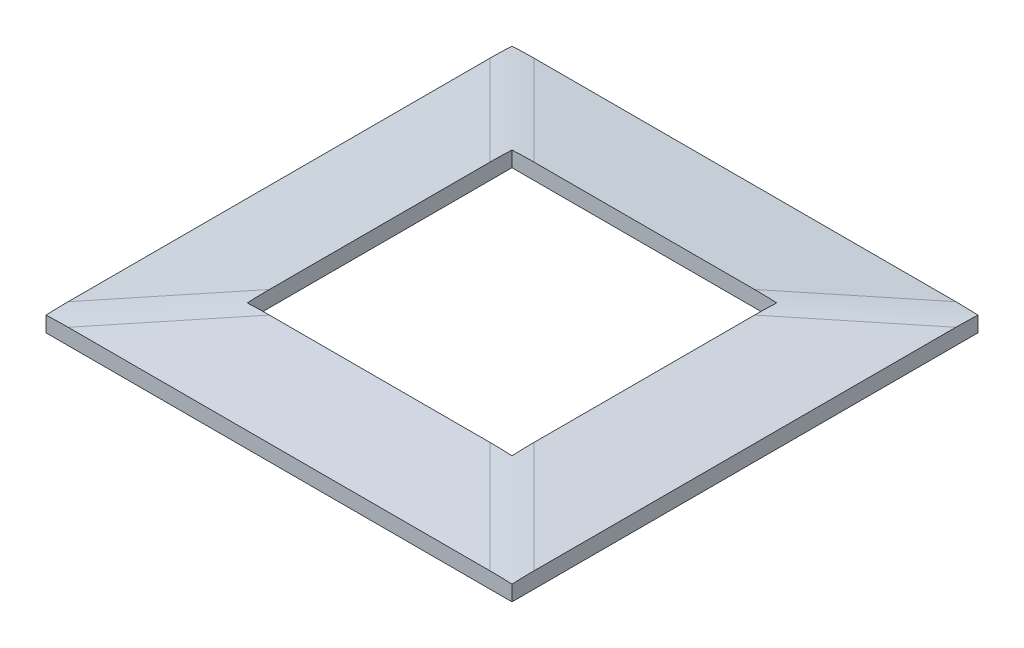
ISO-10303-21;
HEADER;
FILE_DESCRIPTION(('STEP AP214'),'2;1');
FILE_NAME('part.step','',(''),(''),'','','');
FILE_SCHEMA(('AUTOMOTIVE_DESIGN { 1 0 10303 214 1 1 1 1 }'));
ENDSEC;
DATA;
#1=APPLICATION_CONTEXT('core data for automotive mechanical design processes');
#2=APPLICATION_PROTOCOL_DEFINITION('international standard','automotive_design',2000,#1);
#3=PRODUCT_CONTEXT('',#1,'mechanical');
#4=PRODUCT('Part','Part','',(#3));
#5=PRODUCT_RELATED_PRODUCT_CATEGORY('part','',(#4));
#6=PRODUCT_DEFINITION_FORMATION('','',#4);
#7=PRODUCT_DEFINITION_CONTEXT('part definition',#1,'design');
#8=PRODUCT_DEFINITION('design','',#6,#7);
#9=PRODUCT_DEFINITION_SHAPE('','',#8);
#10=(LENGTH_UNIT() NAMED_UNIT(*) SI_UNIT(.MILLI.,.METRE.));
#11=(NAMED_UNIT(*) PLANE_ANGLE_UNIT() SI_UNIT($,.RADIAN.));
#12=(NAMED_UNIT(*) SI_UNIT($,.STERADIAN.) SOLID_ANGLE_UNIT());
#13=UNCERTAINTY_MEASURE_WITH_UNIT(LENGTH_MEASURE(1.E-05),#10,'distance_accuracy_value','');
#14=(GEOMETRIC_REPRESENTATION_CONTEXT(3) GLOBAL_UNCERTAINTY_ASSIGNED_CONTEXT((#13)) GLOBAL_UNIT_ASSIGNED_CONTEXT((#10,
#11,#12)) REPRESENTATION_CONTEXT('',''));
#15=CARTESIAN_POINT('',(0.,0.,0.));
#16=DIRECTION('',(0.,0.,1.));
#17=DIRECTION('',(1.,0.,0.));
#18=AXIS2_PLACEMENT_3D('',#15,#16,#17);
#19=CARTESIAN_POINT('',(44.,3.00000000000001,-44.));
#20=DIRECTION('',(0.,-0.994505452921406,0.104684784518043));
#21=DIRECTION('',(0.,-0.104684784518043,-0.994505452921406));
#22=AXIS2_PLACEMENT_3D('',#19,#20,#21);
#23=PLANE('',#22);
#24=DIRECTION('',(-1.,0.,0.));
#25=VECTOR('',#24,1.);
#26=CARTESIAN_POINT('',(44.,5.00000000000001,-25.));
#27=LINE('',#26,#25);
#28=CARTESIAN_POINT('',(20.8126086192783,5.00000000000001,-25.));
#29=VERTEX_POINT('',#28);
#30=CARTESIAN_POINT('',(-20.8126086192782,5.00000000000001,-25.));
#31=VERTEX_POINT('',#30);
#32=EDGE_CURVE('E260',#29,#31,#27,.T.);
#33=ORIENTED_EDGE('',*,*,#32,.F.);
#34=DIRECTION('',(-0.705156138073945,0.0742269619025208,0.705156138073945));
#35=VECTOR('',#34,1.);
#36=CARTESIAN_POINT('',(41.8947687961936,2.78082524453524,-46.0821601769153));
#37=LINE('',#36,#35);
#38=CARTESIAN_POINT('',(39.8126086192783,3.00000000000001,-44.));
#39=VERTEX_POINT('',#38);
#40=EDGE_CURVE('E224',#29,#39,#37,.F.);
#41=ORIENTED_EDGE('',*,*,#40,.T.);
#42=DIRECTION('',(-1.,0.,0.));
#43=VECTOR('',#42,1.);
#44=CARTESIAN_POINT('',(44.,3.00000000000001,-44.));
#45=LINE('',#44,#43);
#46=CARTESIAN_POINT('',(-39.8126086192781,3.00000000000001,-44.));
#47=VERTEX_POINT('',#46);
#48=EDGE_CURVE('E300',#39,#47,#45,.T.);
#49=ORIENTED_EDGE('',*,*,#48,.T.);
#50=DIRECTION('',(-0.705156138073945,-0.0742269619025208,-0.705156138073945));
#51=VECTOR('',#50,1.);
#52=CARTESIAN_POINT('',(-22.8947687961936,4.78082524453524,-27.0821601769154));
#53=LINE('',#52,#51);
#54=EDGE_CURVE('E222',#47,#31,#53,.F.);
#55=ORIENTED_EDGE('',*,*,#54,.T.);
#56=EDGE_LOOP('',(#33,#41,#49,#55));
#57=FACE_BOUND('',#56,.T.);
#58=ADVANCED_FACE('F38',(#57),#23,.F.);
#59=CARTESIAN_POINT('',(44.,2.99999999999999,44.));
#60=DIRECTION('',(0.,-0.994505452921406,-0.104684784518043));
#61=DIRECTION('',(0.,0.104684784518043,-0.994505452921406));
#62=AXIS2_PLACEMENT_3D('',#59,#60,#61);
#63=PLANE('',#62);
#64=DIRECTION('',(-1.,0.,0.));
#65=VECTOR('',#64,1.);
#66=CARTESIAN_POINT('',(44.,5.,25.));
#67=LINE('',#66,#65);
#68=CARTESIAN_POINT('',(20.8126086192784,5.,25.));
#69=VERTEX_POINT('',#68);
#70=CARTESIAN_POINT('',(-20.8126086192783,5.,25.));
#71=VERTEX_POINT('',#70);
#72=EDGE_CURVE('E256',#69,#71,#67,.T.);
#73=ORIENTED_EDGE('',*,*,#72,.T.);
#74=DIRECTION('',(0.705156138073945,0.0742269619025208,-0.705156138073945));
#75=VECTOR('',#74,1.);
#76=CARTESIAN_POINT('',(-41.8947687961936,2.78082524453523,46.0821601769153));
#77=LINE('',#76,#75);
#78=CARTESIAN_POINT('',(-39.8126086192783,2.99999999999999,44.));
#79=VERTEX_POINT('',#78);
#80=EDGE_CURVE('E53',#71,#79,#77,.F.);
#81=ORIENTED_EDGE('',*,*,#80,.T.);
#82=DIRECTION('',(-1.,0.,0.));
#83=VECTOR('',#82,1.);
#84=CARTESIAN_POINT('',(44.,2.99999999999999,44.));
#85=LINE('',#84,#83);
#86=CARTESIAN_POINT('',(39.8126086192784,2.99999999999999,44.));
#87=VERTEX_POINT('',#86);
#88=EDGE_CURVE('E257',#87,#79,#85,.T.);
#89=ORIENTED_EDGE('',*,*,#88,.F.);
#90=DIRECTION('',(0.705156138073945,-0.0742269619025208,0.705156138073945));
#91=VECTOR('',#90,1.);
#92=CARTESIAN_POINT('',(22.8947687961937,4.78082524453525,27.0821601769153));
#93=LINE('',#92,#91);
#94=EDGE_CURVE('E251',#87,#69,#93,.F.);
#95=ORIENTED_EDGE('',*,*,#94,.T.);
#96=EDGE_LOOP('',(#73,#81,#89,#95));
#97=FACE_BOUND('',#96,.T.);
#98=ADVANCED_FACE('F255',(#97),#63,.F.);
#99=CARTESIAN_POINT('',(44.,0.,0.));
#100=DIRECTION('',(-1.,0.,0.));
#101=DIRECTION('',(0.,0.,1.));
#102=AXIS2_PLACEMENT_3D('',#99,#100,#101);
#103=PLANE('',#102);
#104=DIRECTION('',(0.,1.,0.));
#105=VECTOR('',#104,1.);
#106=CARTESIAN_POINT('',(44.,0.,-44.));
#107=LINE('',#106,#105);
#108=CARTESIAN_POINT('',(44.,0.,-44.));
#109=VERTEX_POINT('',#108);
#110=CARTESIAN_POINT('',(44.,2.88965412361021,-44.));
#111=VERTEX_POINT('',#110);
#112=EDGE_CURVE('E288',#109,#111,#107,.T.);
#113=ORIENTED_EDGE('',*,*,#112,.T.);
#114=CARTESIAN_POINT('',(44.,-37.2209961569322,-44.));
#115=DIRECTION('',(-1.,0.,0.));
#116=DIRECTION('',(0.,-0.104684784518043,-0.994505452921406));
#117=AXIS2_PLACEMENT_3D('',#114,#115,#116);
#118=ELLIPSE('',#117,56.7250256223473,40.);
#119=CARTESIAN_POINT('',(44.,3.00000000000001,-39.8126086192783));
#120=VERTEX_POINT('',#119);
#121=EDGE_CURVE('E232',#111,#120,#118,.F.);
#122=ORIENTED_EDGE('',*,*,#121,.T.);
#123=DIRECTION('',(0.,0.,1.));
#124=VECTOR('',#123,1.);
#125=CARTESIAN_POINT('',(44.,3.00000000000001,-44.));
#126=LINE('',#125,#124);
#127=CARTESIAN_POINT('',(44.,3.00000000000001,39.8126086192781));
#128=VERTEX_POINT('',#127);
#129=EDGE_CURVE('E275',#120,#128,#126,.T.);
#130=ORIENTED_EDGE('',*,*,#129,.T.);
#131=CARTESIAN_POINT('',(44.,-37.2209961569322,43.9999999999999));
#132=DIRECTION('',(-1.,0.,0.));
#133=DIRECTION('',(0.,0.104684784518043,-0.994505452921406));
#134=AXIS2_PLACEMENT_3D('',#131,#132,#133);
#135=ELLIPSE('',#134,56.7250256223473,40.);
#136=CARTESIAN_POINT('',(44.,2.88965412361021,44.));
#137=VERTEX_POINT('',#136);
#138=EDGE_CURVE('E230',#128,#137,#135,.F.);
#139=ORIENTED_EDGE('',*,*,#138,.T.);
#140=DIRECTION('',(0.,-1.,0.));
#141=VECTOR('',#140,1.);
#142=CARTESIAN_POINT('',(44.,0.,44.));
#143=LINE('',#142,#141);
#144=CARTESIAN_POINT('',(44.,0.,44.));
#145=VERTEX_POINT('',#144);
#146=EDGE_CURVE('E283',#137,#145,#143,.T.);
#147=ORIENTED_EDGE('',*,*,#146,.T.);
#148=DIRECTION('',(0.,0.,-1.));
#149=VECTOR('',#148,1.);
#150=CARTESIAN_POINT('',(44.,0.,-44.));
#151=LINE('',#150,#149);
#152=EDGE_CURVE('E285',#145,#109,#151,.T.);
#153=ORIENTED_EDGE('',*,*,#152,.T.);
#154=EDGE_LOOP('',(#113,#122,#130,#139,#147,#153));
#155=FACE_BOUND('',#154,.T.);
#156=ADVANCED_FACE('F344',(#155),#103,.F.);
#157=CARTESIAN_POINT('',(-44.,0.,0.));
#158=DIRECTION('',(-1.,0.,0.));
#159=DIRECTION('',(0.,0.,1.));
#160=AXIS2_PLACEMENT_3D('',#157,#158,#159);
#161=PLANE('',#160);
#162=DIRECTION('',(0.,0.,1.));
#163=VECTOR('',#162,1.);
#164=CARTESIAN_POINT('',(-44.,2.99999999999999,-44.));
#165=LINE('',#164,#163);
#166=CARTESIAN_POINT('',(-44.,2.99999999999999,-39.8126086192784));
#167=VERTEX_POINT('',#166);
#168=CARTESIAN_POINT('',(-44.,2.99999999999999,39.8126086192783));
#169=VERTEX_POINT('',#168);
#170=EDGE_CURVE('E277',#167,#169,#165,.T.);
#171=ORIENTED_EDGE('',*,*,#170,.F.);
#172=CARTESIAN_POINT('',(-44.,-37.2209961569322,-44.0000000000001));
#173=DIRECTION('',(-1.,0.,0.));
#174=DIRECTION('',(0.,0.104684784518043,0.994505452921406));
#175=AXIS2_PLACEMENT_3D('',#172,#173,#174);
#176=ELLIPSE('',#175,56.7250256223473,40.);
#177=CARTESIAN_POINT('',(-44.,2.8896541236102,-44.));
#178=VERTEX_POINT('',#177);
#179=EDGE_CURVE('E242',#167,#178,#176,.T.);
#180=ORIENTED_EDGE('',*,*,#179,.T.);
#181=DIRECTION('',(0.,1.,0.));
#182=VECTOR('',#181,1.);
#183=CARTESIAN_POINT('',(-44.,0.,-44.));
#184=LINE('',#183,#182);
#185=CARTESIAN_POINT('',(-44.,0.,-44.));
#186=VERTEX_POINT('',#185);
#187=EDGE_CURVE('E286',#186,#178,#184,.T.);
#188=ORIENTED_EDGE('',*,*,#187,.F.);
#189=DIRECTION('',(0.,0.,-1.));
#190=VECTOR('',#189,1.);
#191=CARTESIAN_POINT('',(-44.,0.,-44.));
#192=LINE('',#191,#190);
#193=CARTESIAN_POINT('',(-44.,0.,44.));
#194=VERTEX_POINT('',#193);
#195=EDGE_CURVE('E293',#194,#186,#192,.T.);
#196=ORIENTED_EDGE('',*,*,#195,.F.);
#197=DIRECTION('',(0.,-1.,0.));
#198=VECTOR('',#197,1.);
#199=CARTESIAN_POINT('',(-44.,0.,44.));
#200=LINE('',#199,#198);
#201=CARTESIAN_POINT('',(-44.,2.88965412361021,44.));
#202=VERTEX_POINT('',#201);
#203=EDGE_CURVE('E291',#202,#194,#200,.T.);
#204=ORIENTED_EDGE('',*,*,#203,.F.);
#205=CARTESIAN_POINT('',(-44.,-37.2209961569322,44.));
#206=DIRECTION('',(-1.,0.,0.));
#207=DIRECTION('',(0.,-0.104684784518043,0.994505452921406));
#208=AXIS2_PLACEMENT_3D('',#205,#206,#207);
#209=ELLIPSE('',#208,56.7250256223473,40.);
#210=EDGE_CURVE('E240',#202,#169,#209,.T.);
#211=ORIENTED_EDGE('',*,*,#210,.T.);
#212=EDGE_LOOP('',(#171,#180,#188,#196,#204,#211));
#213=FACE_BOUND('',#212,.T.);
#214=ADVANCED_FACE('F319',(#213),#161,.T.);
#215=CARTESIAN_POINT('',(44.,0.,44.));
#216=DIRECTION('',(0.,0.,-1.));
#217=DIRECTION('',(-1.,0.,0.));
#218=AXIS2_PLACEMENT_3D('',#215,#216,#217);
#219=PLANE('',#218);
#220=ORIENTED_EDGE('',*,*,#88,.T.);
#221=CARTESIAN_POINT('',(-44.,-37.2209961569322,44.));
#222=DIRECTION('',(0.,0.,-1.));
#223=DIRECTION('',(-0.994505452921406,-0.104684784518043,0.));
#224=AXIS2_PLACEMENT_3D('',#221,#222,#223);
#225=ELLIPSE('',#224,56.7250256223473,40.);
#226=EDGE_CURVE('E12',#79,#202,#225,.F.);
#227=ORIENTED_EDGE('',*,*,#226,.T.);
#228=ORIENTED_EDGE('',*,*,#203,.T.);
#229=DIRECTION('',(-1.,0.,0.));
#230=VECTOR('',#229,1.);
#231=CARTESIAN_POINT('',(44.,0.,44.));
#232=LINE('',#231,#230);
#233=EDGE_CURVE('E196',#145,#194,#232,.T.);
#234=ORIENTED_EDGE('',*,*,#233,.F.);
#235=ORIENTED_EDGE('',*,*,#146,.F.);
#236=CARTESIAN_POINT('',(44.0000000000001,-37.2209961569322,44.));
#237=DIRECTION('',(0.,0.,-1.));
#238=DIRECTION('',(-0.994505452921406,0.104684784518043,0.));
#239=AXIS2_PLACEMENT_3D('',#236,#237,#238);
#240=ELLIPSE('',#239,56.7250256223473,40.);
#241=EDGE_CURVE('E46',#137,#87,#240,.F.);
#242=ORIENTED_EDGE('',*,*,#241,.T.);
#243=EDGE_LOOP('',(#220,#227,#228,#234,#235,#242));
#244=FACE_BOUND('',#243,.T.);
#245=ADVANCED_FACE('F312',(#244),#219,.F.);
#246=CARTESIAN_POINT('',(44.,0.,-44.));
#247=DIRECTION('',(0.,1.,0.));
#248=DIRECTION('',(0.,0.,1.));
#249=AXIS2_PLACEMENT_3D('',#246,#247,#248);
#250=PLANE('',#249);
#251=DIRECTION('',(-1.,0.,0.));
#252=VECTOR('',#251,1.);
#253=CARTESIAN_POINT('',(-41.5,0.,42.0556324276603));
#254=LINE('',#253,#252);
#255=CARTESIAN_POINT('',(41.5,0.,42.0556324276603));
#256=VERTEX_POINT('',#255);
#257=CARTESIAN_POINT('',(-41.5,0.,42.0556324276603));
#258=VERTEX_POINT('',#257);
#259=EDGE_CURVE('E398',#256,#258,#254,.T.);
#260=ORIENTED_EDGE('',*,*,#259,.F.);
#261=DIRECTION('',(0.,0.,1.));
#262=VECTOR('',#261,1.);
#263=CARTESIAN_POINT('',(41.5,0.,42.0556324276603));
#264=LINE('',#263,#262);
#265=CARTESIAN_POINT('',(41.5,0.,-42.0556324276603));
#266=VERTEX_POINT('',#265);
#267=EDGE_CURVE('E401',#266,#256,#264,.T.);
#268=ORIENTED_EDGE('',*,*,#267,.F.);
#269=DIRECTION('',(1.,0.,0.));
#270=VECTOR('',#269,1.);
#271=CARTESIAN_POINT('',(-41.5,0.,-42.0556324276603));
#272=LINE('',#271,#270);
#273=CARTESIAN_POINT('',(-41.5,0.,-42.0556324276603));
#274=VERTEX_POINT('',#273);
#275=EDGE_CURVE('E391',#274,#266,#272,.T.);
#276=ORIENTED_EDGE('',*,*,#275,.F.);
#277=DIRECTION('',(0.,0.,-1.));
#278=VECTOR('',#277,1.);
#279=CARTESIAN_POINT('',(-41.5,0.,42.0556324276603));
#280=LINE('',#279,#278);
#281=EDGE_CURVE('E395',#258,#274,#280,.T.);
#282=ORIENTED_EDGE('',*,*,#281,.F.);
#283=EDGE_LOOP('',(#260,#268,#276,#282));
#284=FACE_BOUND('',#283,.T.);
#285=ORIENTED_EDGE('',*,*,#195,.T.);
#286=DIRECTION('',(-1.,0.,0.));
#287=VECTOR('',#286,1.);
#288=CARTESIAN_POINT('',(44.,0.,-44.));
#289=LINE('',#288,#287);
#290=EDGE_CURVE('E303',#109,#186,#289,.T.);
#291=ORIENTED_EDGE('',*,*,#290,.F.);
#292=ORIENTED_EDGE('',*,*,#152,.F.);
#293=ORIENTED_EDGE('',*,*,#233,.T.);
#294=EDGE_LOOP('',(#285,#291,#292,#293));
#295=FACE_BOUND('',#294,.T.);
#296=ADVANCED_FACE('F309',(#284,#295),#250,.F.);
#297=CARTESIAN_POINT('',(44.,0.,-44.));
#298=DIRECTION('',(0.,0.,1.));
#299=DIRECTION('',(1.,0.,0.));
#300=AXIS2_PLACEMENT_3D('',#297,#298,#299);
#301=PLANE('',#300);
#302=ORIENTED_EDGE('',*,*,#48,.F.);
#303=CARTESIAN_POINT('',(44.,-37.2209961569322,-44.));
#304=DIRECTION('',(0.,0.,1.));
#305=DIRECTION('',(0.994505452921406,-0.104684784518043,0.));
#306=AXIS2_PLACEMENT_3D('',#303,#304,#305);
#307=ELLIPSE('',#306,56.7250256223473,40.);
#308=EDGE_CURVE('E228',#39,#111,#307,.F.);
#309=ORIENTED_EDGE('',*,*,#308,.T.);
#310=ORIENTED_EDGE('',*,*,#112,.F.);
#311=ORIENTED_EDGE('',*,*,#290,.T.);
#312=ORIENTED_EDGE('',*,*,#187,.T.);
#313=CARTESIAN_POINT('',(-43.9999999999999,-37.2209961569322,-44.));
#314=DIRECTION('',(0.,0.,1.));
#315=DIRECTION('',(0.994505452921406,0.104684784518043,0.));
#316=AXIS2_PLACEMENT_3D('',#313,#314,#315);
#317=ELLIPSE('',#316,56.7250256223473,40.);
#318=EDGE_CURVE('E226',#178,#47,#317,.F.);
#319=ORIENTED_EDGE('',*,*,#318,.T.);
#320=EDGE_LOOP('',(#302,#309,#310,#311,#312,#319));
#321=FACE_BOUND('',#320,.T.);
#322=ADVANCED_FACE('F323',(#321),#301,.F.);
#323=CARTESIAN_POINT('',(-44.,2.99999999999999,-44.));
#324=DIRECTION('',(-0.104684784518043,0.994505452921406,0.));
#325=DIRECTION('',(-0.994505452921406,-0.104684784518043,0.));
#326=AXIS2_PLACEMENT_3D('',#323,#324,#325);
#327=PLANE('',#326);
#328=DIRECTION('',(0.,0.,1.));
#329=VECTOR('',#328,1.);
#330=CARTESIAN_POINT('',(-25.,5.,-44.));
#331=LINE('',#330,#329);
#332=CARTESIAN_POINT('',(-25.,5.,-20.8126086192784));
#333=VERTEX_POINT('',#332);
#334=CARTESIAN_POINT('',(-25.,5.,20.8126086192783));
#335=VERTEX_POINT('',#334);
#336=EDGE_CURVE('E274',#333,#335,#331,.T.);
#337=ORIENTED_EDGE('',*,*,#336,.F.);
#338=DIRECTION('',(-0.705156138073945,-0.0742269619025208,-0.705156138073945));
#339=VECTOR('',#338,1.);
#340=CARTESIAN_POINT('',(-46.0821601769153,2.78082524453523,-41.8947687961937));
#341=LINE('',#340,#339);
#342=EDGE_CURVE('E237',#333,#167,#341,.T.);
#343=ORIENTED_EDGE('',*,*,#342,.T.);
#344=ORIENTED_EDGE('',*,*,#170,.T.);
#345=DIRECTION('',(0.705156138073945,0.0742269619025208,-0.705156138073945));
#346=VECTOR('',#345,1.);
#347=CARTESIAN_POINT('',(-27.0821601769154,4.78082524453524,22.8947687961936));
#348=LINE('',#347,#346);
#349=EDGE_CURVE('E234',#169,#335,#348,.T.);
#350=ORIENTED_EDGE('',*,*,#349,.T.);
#351=EDGE_LOOP('',(#337,#343,#344,#350));
#352=FACE_BOUND('',#351,.T.);
#353=ADVANCED_FACE('F362',(#352),#327,.T.);
#354=CARTESIAN_POINT('',(44.,3.00000000000001,-44.));
#355=DIRECTION('',(0.104684784518043,0.994505452921406,0.));
#356=DIRECTION('',(-0.994505452921406,0.104684784518043,0.));
#357=AXIS2_PLACEMENT_3D('',#354,#355,#356);
#358=PLANE('',#357);
#359=ORIENTED_EDGE('',*,*,#129,.F.);
#360=DIRECTION('',(-0.705156138073945,0.0742269619025208,0.705156138073945));
#361=VECTOR('',#360,1.);
#362=CARTESIAN_POINT('',(27.0821601769154,4.78082524453525,-22.8947687961936));
#363=LINE('',#362,#361);
#364=CARTESIAN_POINT('',(25.,5.00000000000001,-20.8126086192783));
#365=VERTEX_POINT('',#364);
#366=EDGE_CURVE('E211',#120,#365,#363,.T.);
#367=ORIENTED_EDGE('',*,*,#366,.T.);
#368=DIRECTION('',(0.,0.,1.));
#369=VECTOR('',#368,1.);
#370=CARTESIAN_POINT('',(25.,5.00000000000001,-44.));
#371=LINE('',#370,#369);
#372=CARTESIAN_POINT('',(25.,5.00000000000001,20.8126086192782));
#373=VERTEX_POINT('',#372);
#374=EDGE_CURVE('E268',#365,#373,#371,.T.);
#375=ORIENTED_EDGE('',*,*,#374,.T.);
#376=DIRECTION('',(0.705156138073945,-0.0742269619025208,0.705156138073945));
#377=VECTOR('',#376,1.);
#378=CARTESIAN_POINT('',(46.0821601769154,2.78082524453523,41.8947687961936));
#379=LINE('',#378,#377);
#380=EDGE_CURVE('E208',#373,#128,#379,.T.);
#381=ORIENTED_EDGE('',*,*,#380,.T.);
#382=EDGE_LOOP('',(#359,#367,#375,#381));
#383=FACE_BOUND('',#382,.T.);
#384=ADVANCED_FACE('F271',(#383),#358,.T.);
#385=CARTESIAN_POINT('',(41.5,1.99999999999999,42.0556324276603));
#386=DIRECTION('',(1.,0.,0.));
#387=DIRECTION('',(0.,0.,-1.));
#388=AXIS2_PLACEMENT_3D('',#385,#386,#387);
#389=PLANE('',#388);
#390=ORIENTED_EDGE('',*,*,#267,.T.);
#391=DIRECTION('',(0.,-1.,0.));
#392=VECTOR('',#391,1.);
#393=CARTESIAN_POINT('',(41.5,1.99999999999999,42.0556324276603));
#394=LINE('',#393,#392);
#395=CARTESIAN_POINT('',(41.5,1.99999999999999,42.0556324276603));
#396=VERTEX_POINT('',#395);
#397=EDGE_CURVE('E382',#396,#256,#394,.T.);
#398=ORIENTED_EDGE('',*,*,#397,.F.);
#399=DIRECTION('',(0.,0.,1.));
#400=VECTOR('',#399,1.);
#401=CARTESIAN_POINT('',(41.5,1.99999999999999,42.0556324276603));
#402=LINE('',#401,#400);
#403=CARTESIAN_POINT('',(41.5,2.00000000000001,-42.0556324276603));
#404=VERTEX_POINT('',#403);
#405=EDGE_CURVE('E394',#404,#396,#402,.T.);
#406=ORIENTED_EDGE('',*,*,#405,.F.);
#407=DIRECTION('',(0.,-1.,0.));
#408=VECTOR('',#407,1.);
#409=CARTESIAN_POINT('',(41.5,2.00000000000001,-42.0556324276603));
#410=LINE('',#409,#408);
#411=EDGE_CURVE('E279',#404,#266,#410,.T.);
#412=ORIENTED_EDGE('',*,*,#411,.T.);
#413=EDGE_LOOP('',(#390,#398,#406,#412));
#414=FACE_BOUND('',#413,.T.);
#415=ADVANCED_FACE('F419',(#414),#389,.F.);
#416=CARTESIAN_POINT('',(-41.5,2.00000000000001,-42.0556324276603));
#417=DIRECTION('',(0.,0.,-1.));
#418=DIRECTION('',(0.,1.,0.));
#419=AXIS2_PLACEMENT_3D('',#416,#417,#418);
#420=PLANE('',#419);
#421=ORIENTED_EDGE('',*,*,#275,.T.);
#422=ORIENTED_EDGE('',*,*,#411,.F.);
#423=DIRECTION('',(1.,0.,0.));
#424=VECTOR('',#423,1.);
#425=CARTESIAN_POINT('',(-41.5,2.00000000000001,-42.0556324276603));
#426=LINE('',#425,#424);
#427=CARTESIAN_POINT('',(-41.5,2.00000000000001,-42.0556324276603));
#428=VERTEX_POINT('',#427);
#429=EDGE_CURVE('E386',#428,#404,#426,.T.);
#430=ORIENTED_EDGE('',*,*,#429,.F.);
#431=DIRECTION('',(0.,-1.,0.));
#432=VECTOR('',#431,1.);
#433=CARTESIAN_POINT('',(-41.5,2.00000000000001,-42.0556324276603));
#434=LINE('',#433,#432);
#435=EDGE_CURVE('E388',#428,#274,#434,.T.);
#436=ORIENTED_EDGE('',*,*,#435,.T.);
#437=EDGE_LOOP('',(#421,#422,#430,#436));
#438=FACE_BOUND('',#437,.T.);
#439=ADVANCED_FACE('F429',(#438),#420,.F.);
#440=CARTESIAN_POINT('',(-41.5,1.99999999999999,42.0556324276603));
#441=DIRECTION('',(-1.,0.,0.));
#442=DIRECTION('',(0.,0.,1.));
#443=AXIS2_PLACEMENT_3D('',#440,#441,#442);
#444=PLANE('',#443);
#445=ORIENTED_EDGE('',*,*,#281,.T.);
#446=ORIENTED_EDGE('',*,*,#435,.F.);
#447=DIRECTION('',(0.,0.,-1.));
#448=VECTOR('',#447,1.);
#449=CARTESIAN_POINT('',(-41.5,1.99999999999999,42.0556324276603));
#450=LINE('',#449,#448);
#451=CARTESIAN_POINT('',(-41.5,1.99999999999999,42.0556324276603));
#452=VERTEX_POINT('',#451);
#453=EDGE_CURVE('E405',#452,#428,#450,.T.);
#454=ORIENTED_EDGE('',*,*,#453,.F.);
#455=DIRECTION('',(0.,-1.,0.));
#456=VECTOR('',#455,1.);
#457=CARTESIAN_POINT('',(-41.5,1.99999999999999,42.0556324276603));
#458=LINE('',#457,#456);
#459=EDGE_CURVE('E385',#452,#258,#458,.T.);
#460=ORIENTED_EDGE('',*,*,#459,.T.);
#461=EDGE_LOOP('',(#445,#446,#454,#460));
#462=FACE_BOUND('',#461,.T.);
#463=ADVANCED_FACE('F427',(#462),#444,.F.);
#464=CARTESIAN_POINT('',(-41.5,1.99999999999999,42.0556324276603));
#465=DIRECTION('',(0.,0.,1.));
#466=DIRECTION('',(0.,-1.,0.));
#467=AXIS2_PLACEMENT_3D('',#464,#465,#466);
#468=PLANE('',#467);
#469=ORIENTED_EDGE('',*,*,#259,.T.);
#470=ORIENTED_EDGE('',*,*,#459,.F.);
#471=DIRECTION('',(-1.,0.,0.));
#472=VECTOR('',#471,1.);
#473=CARTESIAN_POINT('',(-41.5,1.99999999999999,42.0556324276603));
#474=LINE('',#473,#472);
#475=EDGE_CURVE('E408',#396,#452,#474,.T.);
#476=ORIENTED_EDGE('',*,*,#475,.F.);
#477=ORIENTED_EDGE('',*,*,#397,.T.);
#478=EDGE_LOOP('',(#469,#470,#476,#477));
#479=FACE_BOUND('',#478,.T.);
#480=ADVANCED_FACE('F423',(#479),#468,.F.);
#481=CARTESIAN_POINT('',(0.,2.,0.));
#482=DIRECTION('',(0.,-1.,0.));
#483=DIRECTION('',(0.,0.,-1.));
#484=AXIS2_PLACEMENT_3D('',#481,#482,#483);
#485=PLANE('',#484);
#486=DIRECTION('',(0.,0.,1.));
#487=VECTOR('',#486,1.);
#488=CARTESIAN_POINT('',(25.,2.,0.));
#489=LINE('',#488,#487);
#490=CARTESIAN_POINT('',(25.,2.00000000000001,-25.));
#491=VERTEX_POINT('',#490);
#492=CARTESIAN_POINT('',(25.,1.99999999999999,25.));
#493=VERTEX_POINT('',#492);
#494=EDGE_CURVE('E203',#491,#493,#489,.T.);
#495=ORIENTED_EDGE('',*,*,#494,.F.);
#496=DIRECTION('',(1.,0.,0.));
#497=VECTOR('',#496,1.);
#498=CARTESIAN_POINT('',(0.,2.00000000000001,-25.));
#499=LINE('',#498,#497);
#500=CARTESIAN_POINT('',(-25.,2.,-25.));
#501=VERTEX_POINT('',#500);
#502=EDGE_CURVE('E201',#501,#491,#499,.T.);
#503=ORIENTED_EDGE('',*,*,#502,.F.);
#504=DIRECTION('',(0.,0.,-1.));
#505=VECTOR('',#504,1.);
#506=CARTESIAN_POINT('',(-25.,2.,0.));
#507=LINE('',#506,#505);
#508=CARTESIAN_POINT('',(-25.,1.99999999999999,25.));
#509=VERTEX_POINT('',#508);
#510=EDGE_CURVE('E180',#509,#501,#507,.T.);
#511=ORIENTED_EDGE('',*,*,#510,.F.);
#512=DIRECTION('',(-1.,0.,0.));
#513=VECTOR('',#512,1.);
#514=CARTESIAN_POINT('',(0.,1.99999999999999,25.));
#515=LINE('',#514,#513);
#516=EDGE_CURVE('E190',#493,#509,#515,.T.);
#517=ORIENTED_EDGE('',*,*,#516,.F.);
#518=EDGE_LOOP('',(#495,#503,#511,#517));
#519=FACE_BOUND('',#518,.T.);
#520=ORIENTED_EDGE('',*,*,#405,.T.);
#521=ORIENTED_EDGE('',*,*,#475,.T.);
#522=ORIENTED_EDGE('',*,*,#453,.T.);
#523=ORIENTED_EDGE('',*,*,#429,.T.);
#524=EDGE_LOOP('',(#520,#521,#522,#523));
#525=FACE_BOUND('',#524,.T.);
#526=ADVANCED_FACE('F198',(#519,#525),#485,.T.);
#527=CARTESIAN_POINT('',(25.,5.00000000000002,25.));
#528=DIRECTION('',(1.,0.,0.));
#529=DIRECTION('',(0.,0.,-1.));
#530=AXIS2_PLACEMENT_3D('',#527,#528,#529);
#531=PLANE('',#530);
#532=ORIENTED_EDGE('',*,*,#374,.F.);
#533=CARTESIAN_POINT('',(25.,-35.2209961569322,-25.));
#534=DIRECTION('',(1.,0.,0.));
#535=DIRECTION('',(0.,-0.104684784518043,-0.994505452921406));
#536=AXIS2_PLACEMENT_3D('',#533,#534,#535);
#537=ELLIPSE('',#536,56.7250256223473,40.);
#538=CARTESIAN_POINT('',(25.,4.88965412361022,-25.));
#539=VERTEX_POINT('',#538);
#540=EDGE_CURVE('E216',#365,#539,#537,.F.);
#541=ORIENTED_EDGE('',*,*,#540,.T.);
#542=DIRECTION('',(0.,-1.,0.));
#543=VECTOR('',#542,1.);
#544=CARTESIAN_POINT('',(25.,5.00000000000004,-25.));
#545=LINE('',#544,#543);
#546=EDGE_CURVE('E338',#539,#491,#545,.T.);
#547=ORIENTED_EDGE('',*,*,#546,.T.);
#548=ORIENTED_EDGE('',*,*,#494,.T.);
#549=DIRECTION('',(0.,-1.,0.));
#550=VECTOR('',#549,1.);
#551=CARTESIAN_POINT('',(25.,5.00000000000002,25.));
#552=LINE('',#551,#550);
#553=CARTESIAN_POINT('',(25.,4.88965412361022,25.));
#554=VERTEX_POINT('',#553);
#555=EDGE_CURVE('E187',#554,#493,#552,.T.);
#556=ORIENTED_EDGE('',*,*,#555,.F.);
#557=CARTESIAN_POINT('',(25.,-35.2209961569322,24.9999999999999));
#558=DIRECTION('',(1.,0.,0.));
#559=DIRECTION('',(0.,0.104684784518043,-0.994505452921406));
#560=AXIS2_PLACEMENT_3D('',#557,#558,#559);
#561=ELLIPSE('',#560,56.7250256223473,40.);
#562=EDGE_CURVE('E214',#554,#373,#561,.F.);
#563=ORIENTED_EDGE('',*,*,#562,.T.);
#564=EDGE_LOOP('',(#532,#541,#547,#548,#556,#563));
#565=FACE_BOUND('',#564,.T.);
#566=ADVANCED_FACE('F267',(#565),#531,.F.);
#567=CARTESIAN_POINT('',(-25.,5.00000000000004,-25.));
#568=DIRECTION('',(0.,0.,-1.));
#569=DIRECTION('',(0.,1.,0.));
#570=AXIS2_PLACEMENT_3D('',#567,#568,#569);
#571=PLANE('',#570);
#572=ORIENTED_EDGE('',*,*,#546,.F.);
#573=CARTESIAN_POINT('',(25.,-35.2209961569322,-25.));
#574=DIRECTION('',(0.,0.,-1.));
#575=DIRECTION('',(0.994505452921406,-0.104684784518043,0.));
#576=AXIS2_PLACEMENT_3D('',#573,#574,#575);
#577=ELLIPSE('',#576,56.7250256223473,40.);
#578=EDGE_CURVE('E220',#539,#29,#577,.F.);
#579=ORIENTED_EDGE('',*,*,#578,.T.);
#580=ORIENTED_EDGE('',*,*,#32,.T.);
#581=CARTESIAN_POINT('',(-24.9999999999999,-35.2209961569322,-25.));
#582=DIRECTION('',(0.,0.,-1.));
#583=DIRECTION('',(0.994505452921406,0.104684784518043,0.));
#584=AXIS2_PLACEMENT_3D('',#581,#582,#583);
#585=ELLIPSE('',#584,56.7250256223473,40.);
#586=CARTESIAN_POINT('',(-25.,4.88965412361021,-25.));
#587=VERTEX_POINT('',#586);
#588=EDGE_CURVE('E218',#31,#587,#585,.F.);
#589=ORIENTED_EDGE('',*,*,#588,.T.);
#590=DIRECTION('',(0.,-1.,0.));
#591=VECTOR('',#590,1.);
#592=CARTESIAN_POINT('',(-25.,5.00000000000004,-25.));
#593=LINE('',#592,#591);
#594=EDGE_CURVE('E186',#587,#501,#593,.T.);
#595=ORIENTED_EDGE('',*,*,#594,.T.);
#596=ORIENTED_EDGE('',*,*,#502,.T.);
#597=EDGE_LOOP('',(#572,#579,#580,#589,#595,#596));
#598=FACE_BOUND('',#597,.T.);
#599=ADVANCED_FACE('F336',(#598),#571,.F.);
#600=CARTESIAN_POINT('',(-25.,5.00000000000002,25.));
#601=DIRECTION('',(-1.,0.,0.));
#602=DIRECTION('',(0.,0.,1.));
#603=AXIS2_PLACEMENT_3D('',#600,#601,#602);
#604=PLANE('',#603);
#605=ORIENTED_EDGE('',*,*,#594,.F.);
#606=CARTESIAN_POINT('',(-25.,-35.2209961569322,-25.0000000000001));
#607=DIRECTION('',(-1.,0.,0.));
#608=DIRECTION('',(0.,0.104684784518043,0.994505452921406));
#609=AXIS2_PLACEMENT_3D('',#606,#607,#608);
#610=ELLIPSE('',#609,56.7250256223473,40.);
#611=EDGE_CURVE('E245',#587,#333,#610,.F.);
#612=ORIENTED_EDGE('',*,*,#611,.T.);
#613=ORIENTED_EDGE('',*,*,#336,.T.);
#614=CARTESIAN_POINT('',(-25.,-35.2209961569322,25.));
#615=DIRECTION('',(-1.,0.,0.));
#616=DIRECTION('',(0.,-0.104684784518043,0.994505452921406));
#617=AXIS2_PLACEMENT_3D('',#614,#615,#616);
#618=ELLIPSE('',#617,56.7250256223473,40.);
#619=CARTESIAN_POINT('',(-25.,4.88965412361022,25.));
#620=VERTEX_POINT('',#619);
#621=EDGE_CURVE('E183',#335,#620,#618,.F.);
#622=ORIENTED_EDGE('',*,*,#621,.T.);
#623=DIRECTION('',(0.,-1.,0.));
#624=VECTOR('',#623,1.);
#625=CARTESIAN_POINT('',(-25.,5.00000000000002,25.));
#626=LINE('',#625,#624);
#627=EDGE_CURVE('E175',#620,#509,#626,.T.);
#628=ORIENTED_EDGE('',*,*,#627,.T.);
#629=ORIENTED_EDGE('',*,*,#510,.T.);
#630=EDGE_LOOP('',(#605,#612,#613,#622,#628,#629));
#631=FACE_BOUND('',#630,.T.);
#632=ADVANCED_FACE('F178',(#631),#604,.F.);
#633=CARTESIAN_POINT('',(-25.,5.00000000000002,25.));
#634=DIRECTION('',(0.,0.,1.));
#635=DIRECTION('',(0.,-1.,0.));
#636=AXIS2_PLACEMENT_3D('',#633,#634,#635);
#637=PLANE('',#636);
#638=ORIENTED_EDGE('',*,*,#627,.F.);
#639=CARTESIAN_POINT('',(-25.,-35.2209961569322,25.));
#640=DIRECTION('',(0.,0.,1.));
#641=DIRECTION('',(-0.994505452921406,-0.104684784518043,0.));
#642=AXIS2_PLACEMENT_3D('',#639,#640,#641);
#643=ELLIPSE('',#642,56.7250256223473,40.);
#644=EDGE_CURVE('E249',#620,#71,#643,.F.);
#645=ORIENTED_EDGE('',*,*,#644,.T.);
#646=ORIENTED_EDGE('',*,*,#72,.F.);
#647=CARTESIAN_POINT('',(25.0000000000001,-35.2209961569322,25.));
#648=DIRECTION('',(0.,0.,1.));
#649=DIRECTION('',(-0.994505452921406,0.104684784518043,0.));
#650=AXIS2_PLACEMENT_3D('',#647,#648,#649);
#651=ELLIPSE('',#650,56.7250256223473,40.);
#652=EDGE_CURVE('E247',#69,#554,#651,.F.);
#653=ORIENTED_EDGE('',*,*,#652,.T.);
#654=ORIENTED_EDGE('',*,*,#555,.T.);
#655=ORIENTED_EDGE('',*,*,#516,.T.);
#656=EDGE_LOOP('',(#638,#645,#646,#653,#654,#655));
#657=FACE_BOUND('',#656,.T.);
#658=ADVANCED_FACE('F191',(#657),#637,.F.);
#659=CARTESIAN_POINT('',(41.8947687961936,-36.999392872321,-41.8947687961936));
#660=DIRECTION('',(0.705156138073945,-0.0742269619025208,-0.705156138073945));
#661=DIRECTION('',(-0.707106781186548,0.,-0.707106781186547));
#662=AXIS2_PLACEMENT_3D('',#659,#660,#661);
#663=CYLINDRICAL_SURFACE('',#662,40.);
#664=ORIENTED_EDGE('',*,*,#308,.F.);
#665=ORIENTED_EDGE('',*,*,#40,.F.);
#666=ORIENTED_EDGE('',*,*,#578,.F.);
#667=ORIENTED_EDGE('',*,*,#540,.F.);
#668=ORIENTED_EDGE('',*,*,#366,.F.);
#669=ORIENTED_EDGE('',*,*,#121,.F.);
#670=EDGE_LOOP('',(#664,#665,#666,#667,#668,#669));
#671=FACE_BOUND('',#670,.T.);
#672=ADVANCED_FACE('F341',(#671),#663,.T.);
#673=CARTESIAN_POINT('',(-41.8947687961936,-36.999392872321,-41.8947687961937));
#674=DIRECTION('',(0.705156138073945,0.0742269619025208,0.705156138073945));
#675=DIRECTION('',(0.707106781186548,0.,-0.707106781186547));
#676=AXIS2_PLACEMENT_3D('',#673,#674,#675);
#677=CYLINDRICAL_SURFACE('',#676,40.);
#678=ORIENTED_EDGE('',*,*,#588,.F.);
#679=ORIENTED_EDGE('',*,*,#54,.F.);
#680=ORIENTED_EDGE('',*,*,#318,.F.);
#681=ORIENTED_EDGE('',*,*,#179,.F.);
#682=ORIENTED_EDGE('',*,*,#342,.F.);
#683=ORIENTED_EDGE('',*,*,#611,.F.);
#684=EDGE_LOOP('',(#678,#679,#680,#681,#682,#683));
#685=FACE_BOUND('',#684,.T.);
#686=ADVANCED_FACE('F328',(#685),#677,.T.);
#687=CARTESIAN_POINT('',(1.86280696138213,-32.3933322662604,-1.86280696138214));
#688=DIRECTION('',(-0.705156138073945,-0.0742269619025208,0.705156138073945));
#689=DIRECTION('',(0.707106781186548,0.,0.707106781186547));
#690=AXIS2_PLACEMENT_3D('',#687,#688,#689);
#691=CYLINDRICAL_SURFACE('',#690,40.);
#692=ORIENTED_EDGE('',*,*,#226,.F.);
#693=ORIENTED_EDGE('',*,*,#80,.F.);
#694=ORIENTED_EDGE('',*,*,#644,.F.);
#695=ORIENTED_EDGE('',*,*,#621,.F.);
#696=ORIENTED_EDGE('',*,*,#349,.F.);
#697=ORIENTED_EDGE('',*,*,#210,.F.);
#698=EDGE_LOOP('',(#692,#693,#694,#695,#696,#697));
#699=FACE_BOUND('',#698,.T.);
#700=ADVANCED_FACE('F371',(#699),#691,.T.);
#701=CARTESIAN_POINT('',(-1.86280696138207,-32.3933322662604,-1.86280696138221));
#702=DIRECTION('',(-0.705156138073945,0.0742269619025208,-0.705156138073945));
#703=DIRECTION('',(-0.707106781186548,0.,0.707106781186547));
#704=AXIS2_PLACEMENT_3D('',#701,#702,#703);
#705=CYLINDRICAL_SURFACE('',#704,40.);
#706=ORIENTED_EDGE('',*,*,#652,.F.);
#707=ORIENTED_EDGE('',*,*,#94,.F.);
#708=ORIENTED_EDGE('',*,*,#241,.F.);
#709=ORIENTED_EDGE('',*,*,#138,.F.);
#710=ORIENTED_EDGE('',*,*,#380,.F.);
#711=ORIENTED_EDGE('',*,*,#562,.F.);
#712=EDGE_LOOP('',(#706,#707,#708,#709,#710,#711));
#713=FACE_BOUND('',#712,.T.);
#714=ADVANCED_FACE('F40',(#713),#705,.T.);
#715=CLOSED_SHELL('',(#58,#98,#156,#214,#245,#296,#322,#353,#384,#415,#439,#463,#480,#526,#566,
#599,#632,#658,#672,#686,#700,#714));
#716=MANIFOLD_SOLID_BREP('B2',#715);
#717=ADVANCED_BREP_SHAPE_REPRESENTATION('',(#18,#716),#14);
#718=SHAPE_DEFINITION_REPRESENTATION(#9,#717);
ENDSEC;
END-ISO-10303-21;
